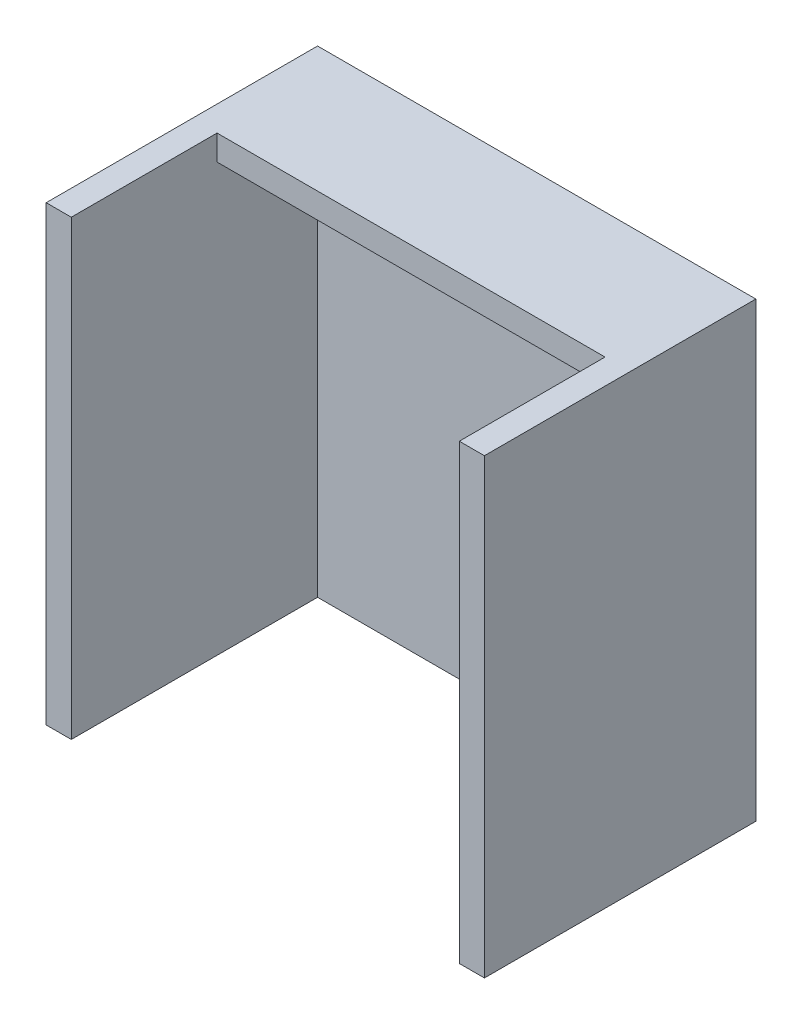
ISO-10303-21;
HEADER;
FILE_DESCRIPTION(('STEP AP214'),'2;1');
FILE_NAME('part.step','',(''),(''),'','','');
FILE_SCHEMA(('AUTOMOTIVE_DESIGN { 1 0 10303 214 1 1 1 1 }'));
ENDSEC;
DATA;
#1=APPLICATION_CONTEXT('core data for automotive mechanical design processes');
#2=APPLICATION_PROTOCOL_DEFINITION('international standard','automotive_design',2000,#1);
#3=PRODUCT_CONTEXT('',#1,'mechanical');
#4=PRODUCT('Part','Part','',(#3));
#5=PRODUCT_RELATED_PRODUCT_CATEGORY('part','',(#4));
#6=PRODUCT_DEFINITION_FORMATION('','',#4);
#7=PRODUCT_DEFINITION_CONTEXT('part definition',#1,'design');
#8=PRODUCT_DEFINITION('design','',#6,#7);
#9=PRODUCT_DEFINITION_SHAPE('','',#8);
#10=(LENGTH_UNIT() NAMED_UNIT(*) SI_UNIT(.MILLI.,.METRE.));
#11=(NAMED_UNIT(*) PLANE_ANGLE_UNIT() SI_UNIT($,.RADIAN.));
#12=(NAMED_UNIT(*) SI_UNIT($,.STERADIAN.) SOLID_ANGLE_UNIT());
#13=UNCERTAINTY_MEASURE_WITH_UNIT(LENGTH_MEASURE(1.E-05),#10,'distance_accuracy_value','');
#14=(GEOMETRIC_REPRESENTATION_CONTEXT(3) GLOBAL_UNCERTAINTY_ASSIGNED_CONTEXT((#13)) GLOBAL_UNIT_ASSIGNED_CONTEXT((#10,
#11,#12)) REPRESENTATION_CONTEXT('',''));
#15=CARTESIAN_POINT('',(0.,0.,0.));
#16=DIRECTION('',(0.,0.,1.));
#17=DIRECTION('',(1.,0.,0.));
#18=AXIS2_PLACEMENT_3D('',#15,#16,#17);
#19=CARTESIAN_POINT('',(0.,0.,34.29));
#20=DIRECTION('',(0.,0.,1.));
#21=DIRECTION('',(1.,0.,0.));
#22=AXIS2_PLACEMENT_3D('',#19,#20,#21);
#23=PLANE('',#22);
#24=DIRECTION('',(0.,-1.,0.));
#25=VECTOR('',#24,1.);
#26=CARTESIAN_POINT('',(-18.161,-23.368,34.29));
#27=LINE('',#26,#25);
#28=CARTESIAN_POINT('',(-18.161,33.782,34.29));
#29=VERTEX_POINT('',#28);
#30=CARTESIAN_POINT('',(-18.161,-23.368,34.29));
#31=VERTEX_POINT('',#30);
#32=EDGE_CURVE('E167',#29,#31,#27,.T.);
#33=ORIENTED_EDGE('',*,*,#32,.F.);
#34=DIRECTION('',(-1.,0.,0.));
#35=VECTOR('',#34,1.);
#36=CARTESIAN_POINT('',(-21.336,33.782,34.29));
#37=LINE('',#36,#35);
#38=CARTESIAN_POINT('',(-21.336,33.782,34.29));
#39=VERTEX_POINT('',#38);
#40=EDGE_CURVE('E179',#29,#39,#37,.T.);
#41=ORIENTED_EDGE('',*,*,#40,.T.);
#42=DIRECTION('',(0.,-1.,0.));
#43=VECTOR('',#42,1.);
#44=CARTESIAN_POINT('',(-21.336,-23.368,34.29));
#45=LINE('',#44,#43);
#46=CARTESIAN_POINT('',(-21.336,-23.368,34.29));
#47=VERTEX_POINT('',#46);
#48=EDGE_CURVE('E56',#39,#47,#45,.T.);
#49=ORIENTED_EDGE('',*,*,#48,.T.);
#50=DIRECTION('',(1.,0.,0.));
#51=VECTOR('',#50,1.);
#52=CARTESIAN_POINT('',(-21.336,-23.368,34.29));
#53=LINE('',#52,#51);
#54=EDGE_CURVE('E175',#47,#31,#53,.T.);
#55=ORIENTED_EDGE('',*,*,#54,.T.);
#56=EDGE_LOOP('',(#33,#41,#49,#55));
#57=FACE_BOUND('',#56,.T.);
#58=ADVANCED_FACE('F39',(#57),#23,.T.);
#59=CARTESIAN_POINT('',(-21.336,30.607,34.29));
#60=DIRECTION('',(0.,-1.,0.));
#61=DIRECTION('',(0.,0.,-1.));
#62=AXIS2_PLACEMENT_3D('',#59,#60,#61);
#63=PLANE('',#62);
#64=DIRECTION('',(0.,0.,-1.));
#65=VECTOR('',#64,1.);
#66=CARTESIAN_POINT('',(30.861,30.607,34.29));
#67=LINE('',#66,#65);
#68=CARTESIAN_POINT('',(30.861,30.607,15.875));
#69=VERTEX_POINT('',#68);
#70=CARTESIAN_POINT('',(30.861,30.607,3.175));
#71=VERTEX_POINT('',#70);
#72=EDGE_CURVE('E131',#69,#71,#67,.T.);
#73=ORIENTED_EDGE('',*,*,#72,.F.);
#74=DIRECTION('',(-1.,0.,0.));
#75=VECTOR('',#74,1.);
#76=CARTESIAN_POINT('',(0.,30.607,15.875));
#77=LINE('',#76,#75);
#78=CARTESIAN_POINT('',(-18.161,30.607,15.875));
#79=VERTEX_POINT('',#78);
#80=EDGE_CURVE('E138',#69,#79,#77,.T.);
#81=ORIENTED_EDGE('',*,*,#80,.T.);
#82=DIRECTION('',(0.,0.,-1.));
#83=VECTOR('',#82,1.);
#84=CARTESIAN_POINT('',(-18.161,30.607,34.29));
#85=LINE('',#84,#83);
#86=CARTESIAN_POINT('',(-18.161,30.607,3.175));
#87=VERTEX_POINT('',#86);
#88=EDGE_CURVE('E151',#79,#87,#85,.T.);
#89=ORIENTED_EDGE('',*,*,#88,.T.);
#90=DIRECTION('',(-1.,0.,0.));
#91=VECTOR('',#90,1.);
#92=CARTESIAN_POINT('',(-21.336,30.607,3.175));
#93=LINE('',#92,#91);
#94=EDGE_CURVE('E149',#71,#87,#93,.T.);
#95=ORIENTED_EDGE('',*,*,#94,.F.);
#96=EDGE_LOOP('',(#73,#81,#89,#95));
#97=FACE_BOUND('',#96,.T.);
#98=ADVANCED_FACE('F147',(#97),#63,.T.);
#99=CARTESIAN_POINT('',(-21.336,-23.368,34.29));
#100=DIRECTION('',(0.,1.,0.));
#101=DIRECTION('',(-1.,0.,0.));
#102=AXIS2_PLACEMENT_3D('',#99,#100,#101);
#103=PLANE('',#102);
#104=CARTESIAN_POINT('',(30.861,-23.368,34.29));
#105=VERTEX_POINT('',#104);
#106=CARTESIAN_POINT('',(34.036,-23.368,34.29));
#107=VERTEX_POINT('',#106);
#108=EDGE_CURVE('E88',#105,#107,#53,.T.);
#109=ORIENTED_EDGE('',*,*,#108,.F.);
#110=DIRECTION('',(0.,0.,-1.));
#111=VECTOR('',#110,1.);
#112=CARTESIAN_POINT('',(30.861,-23.368,34.29));
#113=LINE('',#112,#111);
#114=CARTESIAN_POINT('',(30.861,-23.368,3.175));
#115=VERTEX_POINT('',#114);
#116=EDGE_CURVE('E150',#105,#115,#113,.T.);
#117=ORIENTED_EDGE('',*,*,#116,.T.);
#118=DIRECTION('',(1.,0.,0.));
#119=VECTOR('',#118,1.);
#120=CARTESIAN_POINT('',(-21.336,-23.368,3.175));
#121=LINE('',#120,#119);
#122=CARTESIAN_POINT('',(-18.161,-23.368,3.175));
#123=VERTEX_POINT('',#122);
#124=EDGE_CURVE('E171',#123,#115,#121,.T.);
#125=ORIENTED_EDGE('',*,*,#124,.F.);
#126=DIRECTION('',(0.,0.,-1.));
#127=VECTOR('',#126,1.);
#128=CARTESIAN_POINT('',(-18.161,-23.368,34.29));
#129=LINE('',#128,#127);
#130=EDGE_CURVE('E156',#31,#123,#129,.T.);
#131=ORIENTED_EDGE('',*,*,#130,.F.);
#132=ORIENTED_EDGE('',*,*,#54,.F.);
#133=DIRECTION('',(0.,0.,-1.));
#134=VECTOR('',#133,1.);
#135=CARTESIAN_POINT('',(-21.336,-23.368,34.29));
#136=LINE('',#135,#134);
#137=CARTESIAN_POINT('',(-21.336,-23.368,0.));
#138=VERTEX_POINT('',#137);
#139=EDGE_CURVE('E184',#47,#138,#136,.T.);
#140=ORIENTED_EDGE('',*,*,#139,.T.);
#141=DIRECTION('',(1.,0.,0.));
#142=VECTOR('',#141,1.);
#143=CARTESIAN_POINT('',(-21.336,-23.368,0.));
#144=LINE('',#143,#142);
#145=CARTESIAN_POINT('',(34.036,-23.368,0.));
#146=VERTEX_POINT('',#145);
#147=EDGE_CURVE('E154',#138,#146,#144,.T.);
#148=ORIENTED_EDGE('',*,*,#147,.T.);
#149=DIRECTION('',(0.,0.,-1.));
#150=VECTOR('',#149,1.);
#151=CARTESIAN_POINT('',(34.036,-23.368,34.29));
#152=LINE('',#151,#150);
#153=EDGE_CURVE('E11',#107,#146,#152,.T.);
#154=ORIENTED_EDGE('',*,*,#153,.F.);
#155=EDGE_LOOP('',(#109,#117,#125,#131,#132,#140,#148,#154));
#156=FACE_BOUND('',#155,.T.);
#157=ADVANCED_FACE('F41',(#156),#103,.F.);
#158=CARTESIAN_POINT('',(34.036,-23.368,34.29));
#159=DIRECTION('',(-1.,0.,0.));
#160=DIRECTION('',(0.,0.,1.));
#161=AXIS2_PLACEMENT_3D('',#158,#159,#160);
#162=PLANE('',#161);
#163=DIRECTION('',(0.,1.,0.));
#164=VECTOR('',#163,1.);
#165=CARTESIAN_POINT('',(34.036,-23.368,0.));
#166=LINE('',#165,#164);
#167=CARTESIAN_POINT('',(34.036,33.782,0.));
#168=VERTEX_POINT('',#167);
#169=EDGE_CURVE('E187',#146,#168,#166,.T.);
#170=ORIENTED_EDGE('',*,*,#169,.T.);
#171=DIRECTION('',(0.,0.,-1.));
#172=VECTOR('',#171,1.);
#173=CARTESIAN_POINT('',(34.036,33.782,34.29));
#174=LINE('',#173,#172);
#175=CARTESIAN_POINT('',(34.036,33.782,34.29));
#176=VERTEX_POINT('',#175);
#177=EDGE_CURVE('E48',#176,#168,#174,.T.);
#178=ORIENTED_EDGE('',*,*,#177,.F.);
#179=DIRECTION('',(0.,1.,0.));
#180=VECTOR('',#179,1.);
#181=CARTESIAN_POINT('',(34.036,-23.368,34.29));
#182=LINE('',#181,#180);
#183=EDGE_CURVE('E177',#107,#176,#182,.T.);
#184=ORIENTED_EDGE('',*,*,#183,.F.);
#185=ORIENTED_EDGE('',*,*,#153,.T.);
#186=EDGE_LOOP('',(#170,#178,#184,#185));
#187=FACE_BOUND('',#186,.T.);
#188=ADVANCED_FACE('F216',(#187),#162,.F.);
#189=CARTESIAN_POINT('',(-21.336,33.782,34.29));
#190=DIRECTION('',(0.,-1.,0.));
#191=DIRECTION('',(0.,0.,-1.));
#192=AXIS2_PLACEMENT_3D('',#189,#190,#191);
#193=PLANE('',#192);
#194=ORIENTED_EDGE('',*,*,#40,.F.);
#195=DIRECTION('',(0.,0.,-1.));
#196=VECTOR('',#195,1.);
#197=CARTESIAN_POINT('',(-18.161,33.782,34.29));
#198=LINE('',#197,#196);
#199=CARTESIAN_POINT('',(-18.161,33.782,15.875));
#200=VERTEX_POINT('',#199);
#201=EDGE_CURVE('E208',#29,#200,#198,.T.);
#202=ORIENTED_EDGE('',*,*,#201,.T.);
#203=DIRECTION('',(-1.,0.,0.));
#204=VECTOR('',#203,1.);
#205=CARTESIAN_POINT('',(-21.336,33.782,15.875));
#206=LINE('',#205,#204);
#207=CARTESIAN_POINT('',(30.861,33.782,15.875));
#208=VERTEX_POINT('',#207);
#209=EDGE_CURVE('E173',#208,#200,#206,.T.);
#210=ORIENTED_EDGE('',*,*,#209,.F.);
#211=DIRECTION('',(0.,0.,1.));
#212=VECTOR('',#211,1.);
#213=CARTESIAN_POINT('',(30.861,33.782,34.29));
#214=LINE('',#213,#212);
#215=CARTESIAN_POINT('',(30.861,33.782,34.29));
#216=VERTEX_POINT('',#215);
#217=EDGE_CURVE('E134',#208,#216,#214,.T.);
#218=ORIENTED_EDGE('',*,*,#217,.T.);
#219=EDGE_CURVE('E180',#176,#216,#37,.T.);
#220=ORIENTED_EDGE('',*,*,#219,.F.);
#221=ORIENTED_EDGE('',*,*,#177,.T.);
#222=DIRECTION('',(-1.,0.,0.));
#223=VECTOR('',#222,1.);
#224=CARTESIAN_POINT('',(-21.336,33.782,0.));
#225=LINE('',#224,#223);
#226=CARTESIAN_POINT('',(-21.336,33.782,0.));
#227=VERTEX_POINT('',#226);
#228=EDGE_CURVE('E74',#168,#227,#225,.T.);
#229=ORIENTED_EDGE('',*,*,#228,.T.);
#230=DIRECTION('',(0.,0.,-1.));
#231=VECTOR('',#230,1.);
#232=CARTESIAN_POINT('',(-21.336,33.782,34.29));
#233=LINE('',#232,#231);
#234=EDGE_CURVE('E192',#39,#227,#233,.T.);
#235=ORIENTED_EDGE('',*,*,#234,.F.);
#236=EDGE_LOOP('',(#194,#202,#210,#218,#220,#221,#229,#235));
#237=FACE_BOUND('',#236,.T.);
#238=ADVANCED_FACE('F196',(#237),#193,.F.);
#239=CARTESIAN_POINT('',(-21.336,-23.368,34.29));
#240=DIRECTION('',(1.,0.,0.));
#241=DIRECTION('',(0.,0.,-1.));
#242=AXIS2_PLACEMENT_3D('',#239,#240,#241);
#243=PLANE('',#242);
#244=DIRECTION('',(0.,-1.,0.));
#245=VECTOR('',#244,1.);
#246=CARTESIAN_POINT('',(-21.336,-23.368,0.));
#247=LINE('',#246,#245);
#248=EDGE_CURVE('E80',#227,#138,#247,.T.);
#249=ORIENTED_EDGE('',*,*,#248,.T.);
#250=ORIENTED_EDGE('',*,*,#139,.F.);
#251=ORIENTED_EDGE('',*,*,#48,.F.);
#252=ORIENTED_EDGE('',*,*,#234,.T.);
#253=EDGE_LOOP('',(#249,#250,#251,#252));
#254=FACE_BOUND('',#253,.T.);
#255=ADVANCED_FACE('F205',(#254),#243,.F.);
#256=ORIENTED_EDGE('',*,*,#219,.T.);
#257=DIRECTION('',(0.,1.,0.));
#258=VECTOR('',#257,1.);
#259=CARTESIAN_POINT('',(30.861,-23.368,34.29));
#260=LINE('',#259,#258);
#261=EDGE_CURVE('E165',#105,#216,#260,.T.);
#262=ORIENTED_EDGE('',*,*,#261,.F.);
#263=ORIENTED_EDGE('',*,*,#108,.T.);
#264=ORIENTED_EDGE('',*,*,#183,.T.);
#265=EDGE_LOOP('',(#256,#262,#263,#264));
#266=FACE_BOUND('',#265,.T.);
#267=ADVANCED_FACE('F215',(#266),#23,.T.);
#268=CARTESIAN_POINT('',(0.,0.,0.));
#269=DIRECTION('',(0.,0.,1.));
#270=DIRECTION('',(1.,0.,0.));
#271=AXIS2_PLACEMENT_3D('',#268,#269,#270);
#272=PLANE('',#271);
#273=ORIENTED_EDGE('',*,*,#147,.F.);
#274=ORIENTED_EDGE('',*,*,#248,.F.);
#275=ORIENTED_EDGE('',*,*,#228,.F.);
#276=ORIENTED_EDGE('',*,*,#169,.F.);
#277=EDGE_LOOP('',(#273,#274,#275,#276));
#278=FACE_BOUND('',#277,.T.);
#279=ADVANCED_FACE('F200',(#278),#272,.F.);
#280=CARTESIAN_POINT('',(30.861,-23.368,34.29));
#281=DIRECTION('',(-1.,0.,0.));
#282=DIRECTION('',(0.,0.,1.));
#283=AXIS2_PLACEMENT_3D('',#280,#281,#282);
#284=PLANE('',#283);
#285=DIRECTION('',(0.,1.,0.));
#286=VECTOR('',#285,1.);
#287=CARTESIAN_POINT('',(30.861,-23.368,3.175));
#288=LINE('',#287,#286);
#289=EDGE_CURVE('E160',#115,#71,#288,.T.);
#290=ORIENTED_EDGE('',*,*,#289,.F.);
#291=ORIENTED_EDGE('',*,*,#116,.F.);
#292=ORIENTED_EDGE('',*,*,#261,.T.);
#293=ORIENTED_EDGE('',*,*,#217,.F.);
#294=DIRECTION('',(0.,-1.,0.));
#295=VECTOR('',#294,1.);
#296=CARTESIAN_POINT('',(30.861,69.723,15.875));
#297=LINE('',#296,#295);
#298=EDGE_CURVE('E127',#208,#69,#297,.T.);
#299=ORIENTED_EDGE('',*,*,#298,.T.);
#300=ORIENTED_EDGE('',*,*,#72,.T.);
#301=EDGE_LOOP('',(#290,#291,#292,#293,#299,#300));
#302=FACE_BOUND('',#301,.T.);
#303=ADVANCED_FACE('F129',(#302),#284,.T.);
#304=CARTESIAN_POINT('',(-18.161,-23.368,34.29));
#305=DIRECTION('',(1.,0.,0.));
#306=DIRECTION('',(0.,0.,-1.));
#307=AXIS2_PLACEMENT_3D('',#304,#305,#306);
#308=PLANE('',#307);
#309=DIRECTION('',(0.,-1.,0.));
#310=VECTOR('',#309,1.);
#311=CARTESIAN_POINT('',(-18.161,-23.368,3.175));
#312=LINE('',#311,#310);
#313=EDGE_CURVE('E162',#87,#123,#312,.T.);
#314=ORIENTED_EDGE('',*,*,#313,.F.);
#315=ORIENTED_EDGE('',*,*,#88,.F.);
#316=DIRECTION('',(0.,-1.,0.));
#317=VECTOR('',#316,1.);
#318=CARTESIAN_POINT('',(-18.161,69.723,15.875));
#319=LINE('',#318,#317);
#320=EDGE_CURVE('E137',#200,#79,#319,.T.);
#321=ORIENTED_EDGE('',*,*,#320,.F.);
#322=ORIENTED_EDGE('',*,*,#201,.F.);
#323=ORIENTED_EDGE('',*,*,#32,.T.);
#324=ORIENTED_EDGE('',*,*,#130,.T.);
#325=EDGE_LOOP('',(#314,#315,#321,#322,#323,#324));
#326=FACE_BOUND('',#325,.T.);
#327=ADVANCED_FACE('F211',(#326),#308,.T.);
#328=CARTESIAN_POINT('',(0.,0.,3.175));
#329=DIRECTION('',(0.,0.,1.));
#330=DIRECTION('',(1.,0.,0.));
#331=AXIS2_PLACEMENT_3D('',#328,#329,#330);
#332=PLANE('',#331);
#333=ORIENTED_EDGE('',*,*,#124,.T.);
#334=ORIENTED_EDGE('',*,*,#289,.T.);
#335=ORIENTED_EDGE('',*,*,#94,.T.);
#336=ORIENTED_EDGE('',*,*,#313,.T.);
#337=EDGE_LOOP('',(#333,#334,#335,#336));
#338=FACE_BOUND('',#337,.T.);
#339=ADVANCED_FACE('F256',(#338),#332,.T.);
#340=CARTESIAN_POINT('',(0.,69.723,15.875));
#341=DIRECTION('',(0.,0.,1.));
#342=DIRECTION('',(1.,0.,0.));
#343=AXIS2_PLACEMENT_3D('',#340,#341,#342);
#344=PLANE('',#343);
#345=ORIENTED_EDGE('',*,*,#209,.T.);
#346=ORIENTED_EDGE('',*,*,#320,.T.);
#347=ORIENTED_EDGE('',*,*,#80,.F.);
#348=ORIENTED_EDGE('',*,*,#298,.F.);
#349=EDGE_LOOP('',(#345,#346,#347,#348));
#350=FACE_BOUND('',#349,.T.);
#351=ADVANCED_FACE('F141',(#350),#344,.T.);
#352=CLOSED_SHELL('',(#58,#98,#157,#188,#238,#255,#267,#279,#303,#327,#339,#351));
#353=MANIFOLD_SOLID_BREP('B2',#352);
#354=ADVANCED_BREP_SHAPE_REPRESENTATION('',(#18,#353),#14);
#355=SHAPE_DEFINITION_REPRESENTATION(#9,#354);
ENDSEC;
END-ISO-10303-21;
